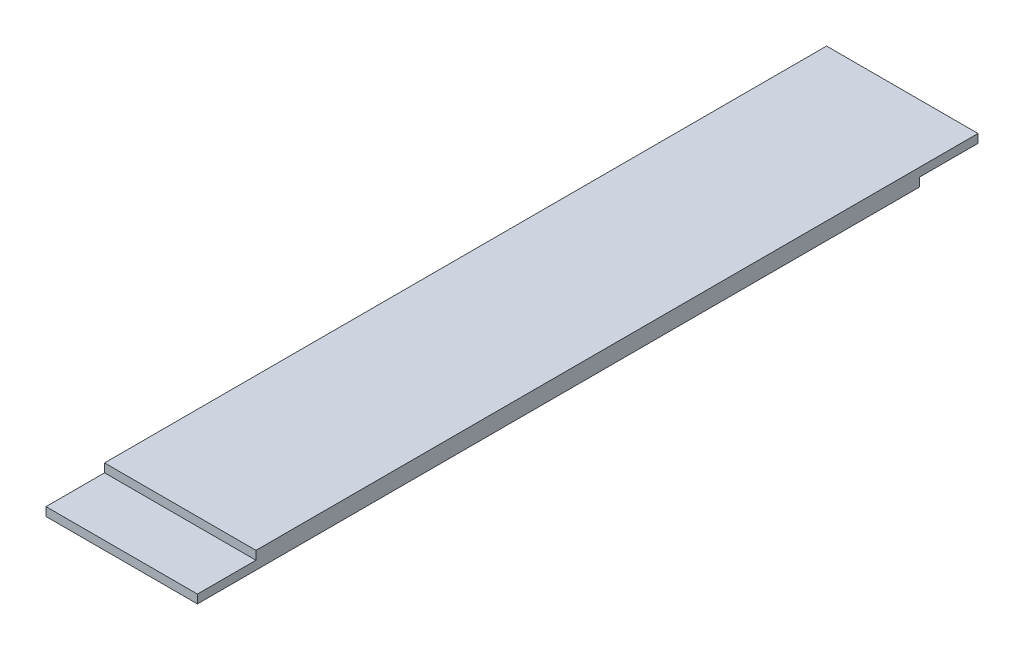
ISO-10303-21;
HEADER;
FILE_DESCRIPTION(('STEP AP214'),'2;1');
FILE_NAME('part.step','',(''),(''),'','','');
FILE_SCHEMA(('AUTOMOTIVE_DESIGN { 1 0 10303 214 1 1 1 1 }'));
ENDSEC;
DATA;
#1=APPLICATION_CONTEXT('core data for automotive mechanical design processes');
#2=APPLICATION_PROTOCOL_DEFINITION('international standard','automotive_design',2000,#1);
#3=PRODUCT_CONTEXT('',#1,'mechanical');
#4=PRODUCT('Part','Part','',(#3));
#5=PRODUCT_RELATED_PRODUCT_CATEGORY('part','',(#4));
#6=PRODUCT_DEFINITION_FORMATION('','',#4);
#7=PRODUCT_DEFINITION_CONTEXT('part definition',#1,'design');
#8=PRODUCT_DEFINITION('design','',#6,#7);
#9=PRODUCT_DEFINITION_SHAPE('','',#8);
#10=(LENGTH_UNIT() NAMED_UNIT(*) SI_UNIT(.MILLI.,.METRE.));
#11=(NAMED_UNIT(*) PLANE_ANGLE_UNIT() SI_UNIT($,.RADIAN.));
#12=(NAMED_UNIT(*) SI_UNIT($,.STERADIAN.) SOLID_ANGLE_UNIT());
#13=UNCERTAINTY_MEASURE_WITH_UNIT(LENGTH_MEASURE(1.E-05),#10,'distance_accuracy_value','');
#14=(GEOMETRIC_REPRESENTATION_CONTEXT(3) GLOBAL_UNCERTAINTY_ASSIGNED_CONTEXT((#13)) GLOBAL_UNIT_ASSIGNED_CONTEXT((#10,
#11,#12)) REPRESENTATION_CONTEXT('',''));
#15=CARTESIAN_POINT('',(0.,0.,0.));
#16=DIRECTION('',(0.,0.,1.));
#17=DIRECTION('',(1.,0.,0.));
#18=AXIS2_PLACEMENT_3D('',#15,#16,#17);
#19=CARTESIAN_POINT('',(19.4,4.4,100.));
#20=DIRECTION('',(-1.,0.,0.));
#21=DIRECTION('',(0.,0.,1.));
#22=AXIS2_PLACEMENT_3D('',#19,#20,#21);
#23=PLANE('',#22);
#24=DIRECTION('',(0.,0.,-1.));
#25=VECTOR('',#24,1.);
#26=CARTESIAN_POINT('',(19.4,0.,100.));
#27=LINE('',#26,#25);
#28=CARTESIAN_POINT('',(19.4,0.,100.));
#29=VERTEX_POINT('',#28);
#30=CARTESIAN_POINT('',(19.4,0.,-84.9999999999999));
#31=VERTEX_POINT('',#30);
#32=EDGE_CURVE('E134',#29,#31,#27,.T.);
#33=ORIENTED_EDGE('',*,*,#32,.T.);
#34=DIRECTION('',(0.,-1.,0.));
#35=VECTOR('',#34,1.);
#36=CARTESIAN_POINT('',(19.4,2.2,-85.));
#37=LINE('',#36,#35);
#38=CARTESIAN_POINT('',(19.4,2.2,-85.));
#39=VERTEX_POINT('',#38);
#40=EDGE_CURVE('E47',#39,#31,#37,.T.);
#41=ORIENTED_EDGE('',*,*,#40,.F.);
#42=DIRECTION('',(0.,0.,1.));
#43=VECTOR('',#42,1.);
#44=CARTESIAN_POINT('',(19.4,2.2,-100.));
#45=LINE('',#44,#43);
#46=CARTESIAN_POINT('',(19.4,2.2,-100.));
#47=VERTEX_POINT('',#46);
#48=EDGE_CURVE('E116',#47,#39,#45,.T.);
#49=ORIENTED_EDGE('',*,*,#48,.F.);
#50=DIRECTION('',(0.,-1.,0.));
#51=VECTOR('',#50,1.);
#52=CARTESIAN_POINT('',(19.4,4.4,-100.));
#53=LINE('',#52,#51);
#54=CARTESIAN_POINT('',(19.4,4.4,-100.));
#55=VERTEX_POINT('',#54);
#56=EDGE_CURVE('E11',#55,#47,#53,.T.);
#57=ORIENTED_EDGE('',*,*,#56,.F.);
#58=DIRECTION('',(0.,0.,-1.));
#59=VECTOR('',#58,1.);
#60=CARTESIAN_POINT('',(19.4,4.4,100.));
#61=LINE('',#60,#59);
#62=CARTESIAN_POINT('',(19.4,4.4,85.));
#63=VERTEX_POINT('',#62);
#64=EDGE_CURVE('E131',#63,#55,#61,.T.);
#65=ORIENTED_EDGE('',*,*,#64,.F.);
#66=DIRECTION('',(0.,1.,0.));
#67=VECTOR('',#66,1.);
#68=CARTESIAN_POINT('',(19.4,2.2,85.));
#69=LINE('',#68,#67);
#70=CARTESIAN_POINT('',(19.4,2.2,85.));
#71=VERTEX_POINT('',#70);
#72=EDGE_CURVE('E55',#71,#63,#69,.T.);
#73=ORIENTED_EDGE('',*,*,#72,.F.);
#74=DIRECTION('',(0.,0.,-1.));
#75=VECTOR('',#74,1.);
#76=CARTESIAN_POINT('',(19.4,2.2,100.));
#77=LINE('',#76,#75);
#78=CARTESIAN_POINT('',(19.4,2.2,100.));
#79=VERTEX_POINT('',#78);
#80=EDGE_CURVE('E151',#79,#71,#77,.T.);
#81=ORIENTED_EDGE('',*,*,#80,.F.);
#82=DIRECTION('',(0.,-1.,0.));
#83=VECTOR('',#82,1.);
#84=CARTESIAN_POINT('',(19.4,4.4,100.));
#85=LINE('',#84,#83);
#86=EDGE_CURVE('E124',#79,#29,#85,.T.);
#87=ORIENTED_EDGE('',*,*,#86,.T.);
#88=EDGE_LOOP('',(#33,#41,#49,#57,#65,#73,#81,#87));
#89=FACE_BOUND('',#88,.T.);
#90=ADVANCED_FACE('F33',(#89),#23,.F.);
#91=CARTESIAN_POINT('',(-19.4,4.4,-100.));
#92=DIRECTION('',(0.,0.,1.));
#93=DIRECTION('',(1.,0.,0.));
#94=AXIS2_PLACEMENT_3D('',#91,#92,#93);
#95=PLANE('',#94);
#96=ORIENTED_EDGE('',*,*,#56,.T.);
#97=DIRECTION('',(1.,0.,0.));
#98=VECTOR('',#97,1.);
#99=CARTESIAN_POINT('',(-19.4,2.2,-100.));
#100=LINE('',#99,#98);
#101=CARTESIAN_POINT('',(-19.4,2.2,-100.));
#102=VERTEX_POINT('',#101);
#103=EDGE_CURVE('E102',#102,#47,#100,.T.);
#104=ORIENTED_EDGE('',*,*,#103,.F.);
#105=DIRECTION('',(0.,-1.,0.));
#106=VECTOR('',#105,1.);
#107=CARTESIAN_POINT('',(-19.4,4.4,-100.));
#108=LINE('',#107,#106);
#109=CARTESIAN_POINT('',(-19.4,4.4,-100.));
#110=VERTEX_POINT('',#109);
#111=EDGE_CURVE('E40',#110,#102,#108,.T.);
#112=ORIENTED_EDGE('',*,*,#111,.F.);
#113=DIRECTION('',(-1.,0.,0.));
#114=VECTOR('',#113,1.);
#115=CARTESIAN_POINT('',(-19.4,4.4,-100.));
#116=LINE('',#115,#114);
#117=EDGE_CURVE('E139',#55,#110,#116,.T.);
#118=ORIENTED_EDGE('',*,*,#117,.F.);
#119=EDGE_LOOP('',(#96,#104,#112,#118));
#120=FACE_BOUND('',#119,.T.);
#121=ADVANCED_FACE('F112',(#120),#95,.F.);
#122=CARTESIAN_POINT('',(-19.4,4.4,100.));
#123=DIRECTION('',(1.,0.,0.));
#124=DIRECTION('',(0.,0.,-1.));
#125=AXIS2_PLACEMENT_3D('',#122,#123,#124);
#126=PLANE('',#125);
#127=DIRECTION('',(0.,0.,-1.));
#128=VECTOR('',#127,1.);
#129=CARTESIAN_POINT('',(-19.4,2.2,-100.));
#130=LINE('',#129,#128);
#131=CARTESIAN_POINT('',(-19.4,2.2,-85.));
#132=VERTEX_POINT('',#131);
#133=EDGE_CURVE('E99',#132,#102,#130,.T.);
#134=ORIENTED_EDGE('',*,*,#133,.F.);
#135=DIRECTION('',(0.,-1.,0.));
#136=VECTOR('',#135,1.);
#137=CARTESIAN_POINT('',(-19.4,2.2,-85.));
#138=LINE('',#137,#136);
#139=CARTESIAN_POINT('',(-19.4,0.,-85.));
#140=VERTEX_POINT('',#139);
#141=EDGE_CURVE('E148',#132,#140,#138,.T.);
#142=ORIENTED_EDGE('',*,*,#141,.T.);
#143=DIRECTION('',(0.,0.,1.));
#144=VECTOR('',#143,1.);
#145=CARTESIAN_POINT('',(-19.4,0.,100.));
#146=LINE('',#145,#144);
#147=CARTESIAN_POINT('',(-19.4,0.,100.));
#148=VERTEX_POINT('',#147);
#149=EDGE_CURVE('E132',#140,#148,#146,.T.);
#150=ORIENTED_EDGE('',*,*,#149,.T.);
#151=DIRECTION('',(0.,-1.,0.));
#152=VECTOR('',#151,1.);
#153=CARTESIAN_POINT('',(-19.4,4.4,100.));
#154=LINE('',#153,#152);
#155=CARTESIAN_POINT('',(-19.4,2.2,100.));
#156=VERTEX_POINT('',#155);
#157=EDGE_CURVE('E122',#156,#148,#154,.T.);
#158=ORIENTED_EDGE('',*,*,#157,.F.);
#159=DIRECTION('',(0.,0.,1.));
#160=VECTOR('',#159,1.);
#161=CARTESIAN_POINT('',(-19.4,2.2,100.));
#162=LINE('',#161,#160);
#163=CARTESIAN_POINT('',(-19.4,2.2,85.));
#164=VERTEX_POINT('',#163);
#165=EDGE_CURVE('E147',#164,#156,#162,.T.);
#166=ORIENTED_EDGE('',*,*,#165,.F.);
#167=DIRECTION('',(0.,1.,0.));
#168=VECTOR('',#167,1.);
#169=CARTESIAN_POINT('',(-19.4,2.2,85.));
#170=LINE('',#169,#168);
#171=CARTESIAN_POINT('',(-19.4,4.4,85.));
#172=VERTEX_POINT('',#171);
#173=EDGE_CURVE('E137',#164,#172,#170,.T.);
#174=ORIENTED_EDGE('',*,*,#173,.T.);
#175=DIRECTION('',(0.,0.,1.));
#176=VECTOR('',#175,1.);
#177=CARTESIAN_POINT('',(-19.4,4.4,100.));
#178=LINE('',#177,#176);
#179=EDGE_CURVE('E121',#110,#172,#178,.T.);
#180=ORIENTED_EDGE('',*,*,#179,.F.);
#181=ORIENTED_EDGE('',*,*,#111,.T.);
#182=EDGE_LOOP('',(#134,#142,#150,#158,#166,#174,#180,#181));
#183=FACE_BOUND('',#182,.T.);
#184=ADVANCED_FACE('F118',(#183),#126,.F.);
#185=CARTESIAN_POINT('',(-19.4,4.4,100.));
#186=DIRECTION('',(0.,0.,-1.));
#187=DIRECTION('',(-1.,0.,0.));
#188=AXIS2_PLACEMENT_3D('',#185,#186,#187);
#189=PLANE('',#188);
#190=ORIENTED_EDGE('',*,*,#86,.F.);
#191=DIRECTION('',(1.,0.,0.));
#192=VECTOR('',#191,1.);
#193=CARTESIAN_POINT('',(-19.4,2.2,100.));
#194=LINE('',#193,#192);
#195=EDGE_CURVE('E153',#156,#79,#194,.T.);
#196=ORIENTED_EDGE('',*,*,#195,.F.);
#197=ORIENTED_EDGE('',*,*,#157,.T.);
#198=DIRECTION('',(1.,0.,0.));
#199=VECTOR('',#198,1.);
#200=CARTESIAN_POINT('',(-19.4,0.,100.));
#201=LINE('',#200,#199);
#202=EDGE_CURVE('E128',#148,#29,#201,.T.);
#203=ORIENTED_EDGE('',*,*,#202,.T.);
#204=EDGE_LOOP('',(#190,#196,#197,#203));
#205=FACE_BOUND('',#204,.T.);
#206=ADVANCED_FACE('F173',(#205),#189,.F.);
#207=CARTESIAN_POINT('',(0.,4.4,0.));
#208=DIRECTION('',(0.,-1.,0.));
#209=DIRECTION('',(0.,0.,-1.));
#210=AXIS2_PLACEMENT_3D('',#207,#208,#209);
#211=PLANE('',#210);
#212=ORIENTED_EDGE('',*,*,#179,.T.);
#213=DIRECTION('',(-1.,0.,0.));
#214=VECTOR('',#213,1.);
#215=CARTESIAN_POINT('',(-19.4,4.4,85.));
#216=LINE('',#215,#214);
#217=EDGE_CURVE('E145',#63,#172,#216,.T.);
#218=ORIENTED_EDGE('',*,*,#217,.F.);
#219=ORIENTED_EDGE('',*,*,#64,.T.);
#220=ORIENTED_EDGE('',*,*,#117,.T.);
#221=EDGE_LOOP('',(#212,#218,#219,#220));
#222=FACE_BOUND('',#221,.T.);
#223=ADVANCED_FACE('F178',(#222),#211,.F.);
#224=CARTESIAN_POINT('',(0.,0.,0.));
#225=DIRECTION('',(0.,-1.,0.));
#226=DIRECTION('',(0.,0.,-1.));
#227=AXIS2_PLACEMENT_3D('',#224,#225,#226);
#228=PLANE('',#227);
#229=DIRECTION('',(-1.,0.,0.));
#230=VECTOR('',#229,1.);
#231=CARTESIAN_POINT('',(-19.4,0.,-85.));
#232=LINE('',#231,#230);
#233=EDGE_CURVE('E108',#31,#140,#232,.T.);
#234=ORIENTED_EDGE('',*,*,#233,.F.);
#235=ORIENTED_EDGE('',*,*,#32,.F.);
#236=ORIENTED_EDGE('',*,*,#202,.F.);
#237=ORIENTED_EDGE('',*,*,#149,.F.);
#238=EDGE_LOOP('',(#234,#235,#236,#237));
#239=FACE_BOUND('',#238,.T.);
#240=ADVANCED_FACE('F167',(#239),#228,.T.);
#241=CARTESIAN_POINT('',(-19.4,2.2,85.));
#242=DIRECTION('',(0.,0.,-1.));
#243=DIRECTION('',(-1.,0.,0.));
#244=AXIS2_PLACEMENT_3D('',#241,#242,#243);
#245=PLANE('',#244);
#246=ORIENTED_EDGE('',*,*,#217,.T.);
#247=ORIENTED_EDGE('',*,*,#173,.F.);
#248=DIRECTION('',(-1.,0.,0.));
#249=VECTOR('',#248,1.);
#250=CARTESIAN_POINT('',(-19.4,2.2,85.));
#251=LINE('',#250,#249);
#252=EDGE_CURVE('E143',#71,#164,#251,.T.);
#253=ORIENTED_EDGE('',*,*,#252,.F.);
#254=ORIENTED_EDGE('',*,*,#72,.T.);
#255=EDGE_LOOP('',(#246,#247,#253,#254));
#256=FACE_BOUND('',#255,.T.);
#257=ADVANCED_FACE('F179',(#256),#245,.F.);
#258=CARTESIAN_POINT('',(0.,2.2,0.));
#259=DIRECTION('',(0.,-1.,0.));
#260=DIRECTION('',(0.,0.,-1.));
#261=AXIS2_PLACEMENT_3D('',#258,#259,#260);
#262=PLANE('',#261);
#263=ORIENTED_EDGE('',*,*,#165,.T.);
#264=ORIENTED_EDGE('',*,*,#195,.T.);
#265=ORIENTED_EDGE('',*,*,#80,.T.);
#266=ORIENTED_EDGE('',*,*,#252,.T.);
#267=EDGE_LOOP('',(#263,#264,#265,#266));
#268=FACE_BOUND('',#267,.T.);
#269=ADVANCED_FACE('F175',(#268),#262,.F.);
#270=CARTESIAN_POINT('',(-19.4,2.2,-85.));
#271=DIRECTION('',(0.,0.,1.));
#272=DIRECTION('',(1.,0.,0.));
#273=AXIS2_PLACEMENT_3D('',#270,#271,#272);
#274=PLANE('',#273);
#275=ORIENTED_EDGE('',*,*,#233,.T.);
#276=ORIENTED_EDGE('',*,*,#141,.F.);
#277=DIRECTION('',(-1.,0.,0.));
#278=VECTOR('',#277,1.);
#279=CARTESIAN_POINT('',(-19.4,2.2,-85.));
#280=LINE('',#279,#278);
#281=EDGE_CURVE('E104',#39,#132,#280,.T.);
#282=ORIENTED_EDGE('',*,*,#281,.F.);
#283=ORIENTED_EDGE('',*,*,#40,.T.);
#284=EDGE_LOOP('',(#275,#276,#282,#283));
#285=FACE_BOUND('',#284,.T.);
#286=ADVANCED_FACE('F161',(#285),#274,.F.);
#287=CARTESIAN_POINT('',(0.,2.2,0.));
#288=DIRECTION('',(0.,1.,0.));
#289=DIRECTION('',(0.,0.,1.));
#290=AXIS2_PLACEMENT_3D('',#287,#288,#289);
#291=PLANE('',#290);
#292=ORIENTED_EDGE('',*,*,#133,.T.);
#293=ORIENTED_EDGE('',*,*,#103,.T.);
#294=ORIENTED_EDGE('',*,*,#48,.T.);
#295=ORIENTED_EDGE('',*,*,#281,.T.);
#296=EDGE_LOOP('',(#292,#293,#294,#295));
#297=FACE_BOUND('',#296,.T.);
#298=ADVANCED_FACE('F101',(#297),#291,.F.);
#299=CLOSED_SHELL('',(#90,#121,#184,#206,#223,#240,#257,#269,#286,#298));
#300=MANIFOLD_SOLID_BREP('B2',#299);
#301=ADVANCED_BREP_SHAPE_REPRESENTATION('',(#18,#300),#14);
#302=SHAPE_DEFINITION_REPRESENTATION(#9,#301);
ENDSEC;
END-ISO-10303-21;
